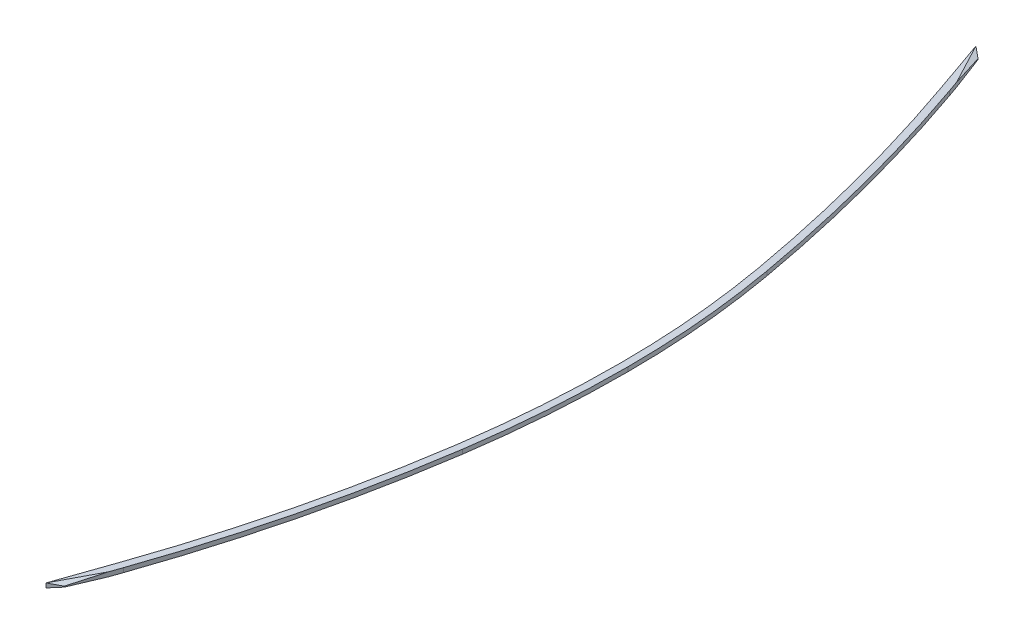
ISO-10303-21;
HEADER;
FILE_DESCRIPTION(('STEP AP214'),'2;1');
FILE_NAME('part.step','',(''),(''),'','','');
FILE_SCHEMA(('AUTOMOTIVE_DESIGN { 1 0 10303 214 1 1 1 1 }'));
ENDSEC;
DATA;
#1=APPLICATION_CONTEXT('core data for automotive mechanical design processes');
#2=APPLICATION_PROTOCOL_DEFINITION('international standard','automotive_design',2000,#1);
#3=PRODUCT_CONTEXT('',#1,'mechanical');
#4=PRODUCT('Part','Part','',(#3));
#5=PRODUCT_RELATED_PRODUCT_CATEGORY('part','',(#4));
#6=PRODUCT_DEFINITION_FORMATION('','',#4);
#7=PRODUCT_DEFINITION_CONTEXT('part definition',#1,'design');
#8=PRODUCT_DEFINITION('design','',#6,#7);
#9=PRODUCT_DEFINITION_SHAPE('','',#8);
#10=(LENGTH_UNIT() NAMED_UNIT(*) SI_UNIT(.MILLI.,.METRE.));
#11=(NAMED_UNIT(*) PLANE_ANGLE_UNIT() SI_UNIT($,.RADIAN.));
#12=(NAMED_UNIT(*) SI_UNIT($,.STERADIAN.) SOLID_ANGLE_UNIT());
#13=UNCERTAINTY_MEASURE_WITH_UNIT(LENGTH_MEASURE(1.E-05),#10,'distance_accuracy_value','');
#14=(GEOMETRIC_REPRESENTATION_CONTEXT(3) GLOBAL_UNCERTAINTY_ASSIGNED_CONTEXT((#13)) GLOBAL_UNIT_ASSIGNED_CONTEXT((#10,
#11,#12)) REPRESENTATION_CONTEXT('',''));
#15=CARTESIAN_POINT('',(0.,0.,0.));
#16=DIRECTION('',(0.,0.,1.));
#17=DIRECTION('',(1.,0.,0.));
#18=AXIS2_PLACEMENT_3D('',#15,#16,#17);
#19=CARTESIAN_POINT('',(-890.408602504765,-2.5,0.));
#20=DIRECTION('',(0.,-1.,0.));
#21=DIRECTION('',(0.,0.,-1.));
#22=AXIS2_PLACEMENT_3D('',#19,#20,#21);
#23=PLANE('',#22);
#24=DIRECTION('',(0.329290672717834,0.,0.944228602013854));
#25=VECTOR('',#24,1.);
#26=CARTESIAN_POINT('',(222.446171183886,-2.5,-457.365674618266));
#27=LINE('',#26,#25);
#28=CARTESIAN_POINT('',(200.603050676646,-2.5,-520.));
#29=VERTEX_POINT('',#28);
#30=CARTESIAN_POINT('',(222.446171183886,-2.5,-457.365674618266));
#31=VERTEX_POINT('',#30);
#32=EDGE_CURVE('E162',#29,#31,#27,.T.);
#33=ORIENTED_EDGE('',*,*,#32,.F.);
#34=DIRECTION('',(0.467302247857305,0.,0.884097624217773));
#35=VECTOR('',#34,1.);
#36=CARTESIAN_POINT('',(177.190538238726,-2.5,-564.294558218463));
#37=LINE('',#36,#35);
#38=CARTESIAN_POINT('',(225.506736635597,-2.5,-472.884263468604));
#39=VERTEX_POINT('',#38);
#40=EDGE_CURVE('E11',#29,#39,#37,.T.);
#41=ORIENTED_EDGE('',*,*,#40,.T.);
#42=DIRECTION('',(-0.329290672717833,0.,-0.944228602013854));
#43=VECTOR('',#42,1.);
#44=CARTESIAN_POINT('',(230.,-2.5,-460.));
#45=LINE('',#44,#43);
#46=CARTESIAN_POINT('',(230.,-2.5,-460.));
#47=VERTEX_POINT('',#46);
#48=EDGE_CURVE('E170',#47,#39,#45,.T.);
#49=ORIENTED_EDGE('',*,*,#48,.F.);
#50=CARTESIAN_POINT('',(-1518.12507111379,-2.5,149.641859433438));
#51=DIRECTION('',(0.,1.,0.));
#52=DIRECTION('',(0.,0.,-1.));
#53=AXIS2_PLACEMENT_3D('',#50,#51,#52);
#54=CIRCLE('',#53,1851.37907005293);
#55=CARTESIAN_POINT('',(304.432317629894,-2.5,-175.764080533639));
#56=VERTEX_POINT('',#55);
#57=EDGE_CURVE('E174',#56,#47,#54,.T.);
#58=ORIENTED_EDGE('',*,*,#57,.F.);
#59=CARTESIAN_POINT('',(-680.,-2.5,0.));
#60=DIRECTION('',(0.,1.,0.));
#61=DIRECTION('',(0.,0.,1.));
#62=AXIS2_PLACEMENT_3D('',#59,#60,#61);
#63=CIRCLE('',#62,1000.);
#64=CARTESIAN_POINT('',(320.,-2.5,0.));
#65=VERTEX_POINT('',#64);
#66=EDGE_CURVE('E279',#65,#56,#63,.T.);
#67=ORIENTED_EDGE('',*,*,#66,.F.);
#68=CARTESIAN_POINT('',(-890.408602504765,-2.5,0.));
#69=DIRECTION('',(0.,1.,0.));
#70=DIRECTION('',(0.,0.,-1.));
#71=AXIS2_PLACEMENT_3D('',#68,#69,#70);
#72=CIRCLE('',#71,1210.40860250476);
#73=CARTESIAN_POINT('',(306.955871138139,-2.5,177.221054830938));
#74=VERTEX_POINT('',#73);
#75=EDGE_CURVE('E281',#74,#65,#72,.T.);
#76=ORIENTED_EDGE('',*,*,#75,.F.);
#77=CARTESIAN_POINT('',(-1384.94196210794,-2.5,-73.1955269821214));
#78=DIRECTION('',(0.,1.,0.));
#79=DIRECTION('',(0.,0.,1.));
#80=AXIS2_PLACEMENT_3D('',#77,#78,#79);
#81=CIRCLE('',#80,1710.32942516631);
#82=CARTESIAN_POINT('',(230.,-2.5,490.));
#83=VERTEX_POINT('',#82);
#84=EDGE_CURVE('E188',#83,#74,#81,.T.);
#85=ORIENTED_EDGE('',*,*,#84,.F.);
#86=DIRECTION('',(0.329290672717831,0.,-0.944228602013855));
#87=VECTOR('',#86,1.);
#88=CARTESIAN_POINT('',(230.,-2.5,490.));
#89=LINE('',#88,#87);
#90=CARTESIAN_POINT('',(225.506736635596,-2.5,502.884263468605));
#91=VERTEX_POINT('',#90);
#92=EDGE_CURVE('E186',#91,#83,#89,.T.);
#93=ORIENTED_EDGE('',*,*,#92,.F.);
#94=DIRECTION('',(-0.467302247857303,0.,0.884097624217773));
#95=VECTOR('',#94,1.);
#96=CARTESIAN_POINT('',(189.584762452396,-2.5,570.845699944036));
#97=LINE('',#96,#95);
#98=CARTESIAN_POINT('',(200.603050676638,-2.5,550.));
#99=VERTEX_POINT('',#98);
#100=EDGE_CURVE('E261',#91,#99,#97,.T.);
#101=ORIENTED_EDGE('',*,*,#100,.T.);
#102=DIRECTION('',(-0.329290672717832,0.,0.944228602013854));
#103=VECTOR('',#102,1.);
#104=CARTESIAN_POINT('',(222.446171183889,-2.5,487.365674618257));
#105=LINE('',#104,#103);
#106=CARTESIAN_POINT('',(222.446171183889,-2.5,487.365674618257));
#107=VERTEX_POINT('',#106);
#108=EDGE_CURVE('E183',#107,#99,#105,.T.);
#109=ORIENTED_EDGE('',*,*,#108,.F.);
#110=CARTESIAN_POINT('',(-1384.94196210794,-2.5,-73.1955269821214));
#111=DIRECTION('',(0.,-1.,0.));
#112=DIRECTION('',(0.,0.,1.));
#113=AXIS2_PLACEMENT_3D('',#110,#111,#112);
#114=CIRCLE('',#113,1702.32942516631);
#115=CARTESIAN_POINT('',(299.042084199314,-2.5,176.049740916188));
#116=VERTEX_POINT('',#115);
#117=EDGE_CURVE('E181',#116,#107,#114,.T.);
#118=ORIENTED_EDGE('',*,*,#117,.F.);
#119=CARTESIAN_POINT('',(-890.408602504765,-2.5,0.));
#120=DIRECTION('',(0.,-1.,0.));
#121=DIRECTION('',(0.,0.,-1.));
#122=AXIS2_PLACEMENT_3D('',#119,#120,#121);
#123=CIRCLE('',#122,1202.40860250476);
#124=CARTESIAN_POINT('',(312.,-2.5,0.));
#125=VERTEX_POINT('',#124);
#126=EDGE_CURVE('E179',#125,#116,#123,.T.);
#127=ORIENTED_EDGE('',*,*,#126,.F.);
#128=CARTESIAN_POINT('',(-680.,-2.5,0.));
#129=DIRECTION('',(0.,-1.,0.));
#130=DIRECTION('',(0.,0.,1.));
#131=AXIS2_PLACEMENT_3D('',#128,#129,#130);
#132=CIRCLE('',#131,992.);
#133=CARTESIAN_POINT('',(296.556859088855,-2.5,-174.35796788937));
#134=VERTEX_POINT('',#133);
#135=EDGE_CURVE('E172',#134,#125,#132,.T.);
#136=ORIENTED_EDGE('',*,*,#135,.F.);
#137=CARTESIAN_POINT('',(-1518.12507111379,-2.5,149.641859433438));
#138=DIRECTION('',(0.,-1.,0.));
#139=DIRECTION('',(0.,0.,-1.));
#140=AXIS2_PLACEMENT_3D('',#137,#138,#139);
#141=CIRCLE('',#140,1843.37907005293);
#142=EDGE_CURVE('E169',#31,#134,#141,.T.);
#143=ORIENTED_EDGE('',*,*,#142,.F.);
#144=EDGE_LOOP('',(#33,#41,#49,#58,#67,#76,#85,#93,#101,#109,#118,#127,#136,#143));
#145=FACE_BOUND('',#144,.T.);
#146=ADVANCED_FACE('F31',(#145),#23,.T.);
#147=CARTESIAN_POINT('',(-890.408602504765,2.5,0.));
#148=DIRECTION('',(0.,-1.,0.));
#149=DIRECTION('',(0.,0.,-1.));
#150=AXIS2_PLACEMENT_3D('',#147,#148,#149);
#151=PLANE('',#150);
#152=DIRECTION('',(-0.329290672717833,0.,-0.944228602013854));
#153=VECTOR('',#152,1.);
#154=CARTESIAN_POINT('',(230.,2.5,-460.));
#155=LINE('',#154,#153);
#156=CARTESIAN_POINT('',(230.,2.5,-460.));
#157=VERTEX_POINT('',#156);
#158=CARTESIAN_POINT('',(225.506736635596,2.5,-472.884263468607));
#159=VERTEX_POINT('',#158);
#160=EDGE_CURVE('E197',#157,#159,#155,.T.);
#161=ORIENTED_EDGE('',*,*,#160,.T.);
#162=DIRECTION('',(-0.467302247857305,0.,-0.884097624217773));
#163=VECTOR('',#162,1.);
#164=CARTESIAN_POINT('',(177.190538238727,2.5,-564.294558218463));
#165=LINE('',#164,#163);
#166=CARTESIAN_POINT('',(200.603050676638,2.5,-520.));
#167=VERTEX_POINT('',#166);
#168=EDGE_CURVE('E157',#159,#167,#165,.T.);
#169=ORIENTED_EDGE('',*,*,#168,.T.);
#170=DIRECTION('',(0.329290672717834,0.,0.944228602013854));
#171=VECTOR('',#170,1.);
#172=CARTESIAN_POINT('',(222.446171183886,2.5,-457.365674618266));
#173=LINE('',#172,#171);
#174=CARTESIAN_POINT('',(222.446171183886,2.5,-457.365674618266));
#175=VERTEX_POINT('',#174);
#176=EDGE_CURVE('E164',#167,#175,#173,.T.);
#177=ORIENTED_EDGE('',*,*,#176,.T.);
#178=CARTESIAN_POINT('',(-1518.12507111379,2.5,149.641859433438));
#179=DIRECTION('',(0.,-1.,0.));
#180=DIRECTION('',(0.,0.,-1.));
#181=AXIS2_PLACEMENT_3D('',#178,#179,#180);
#182=CIRCLE('',#181,1843.37907005293);
#183=CARTESIAN_POINT('',(296.556859088855,2.5,-174.35796788937));
#184=VERTEX_POINT('',#183);
#185=EDGE_CURVE('E201',#175,#184,#182,.T.);
#186=ORIENTED_EDGE('',*,*,#185,.T.);
#187=CARTESIAN_POINT('',(-680.,2.5,0.));
#188=DIRECTION('',(0.,-1.,0.));
#189=DIRECTION('',(0.,0.,1.));
#190=AXIS2_PLACEMENT_3D('',#187,#188,#189);
#191=CIRCLE('',#190,992.);
#192=CARTESIAN_POINT('',(312.,2.5,0.));
#193=VERTEX_POINT('',#192);
#194=EDGE_CURVE('E203',#184,#193,#191,.T.);
#195=ORIENTED_EDGE('',*,*,#194,.T.);
#196=CARTESIAN_POINT('',(-890.408602504765,2.5,0.));
#197=DIRECTION('',(0.,-1.,0.));
#198=DIRECTION('',(0.,0.,-1.));
#199=AXIS2_PLACEMENT_3D('',#196,#197,#198);
#200=CIRCLE('',#199,1202.40860250476);
#201=CARTESIAN_POINT('',(299.042084199314,2.5,176.049740916188));
#202=VERTEX_POINT('',#201);
#203=EDGE_CURVE('E205',#193,#202,#200,.T.);
#204=ORIENTED_EDGE('',*,*,#203,.T.);
#205=CARTESIAN_POINT('',(-1384.94196210794,2.5,-73.1955269821214));
#206=DIRECTION('',(0.,-1.,0.));
#207=DIRECTION('',(0.,0.,1.));
#208=AXIS2_PLACEMENT_3D('',#205,#206,#207);
#209=CIRCLE('',#208,1702.32942516631);
#210=CARTESIAN_POINT('',(222.446171183889,2.5,487.365674618257));
#211=VERTEX_POINT('',#210);
#212=EDGE_CURVE('E207',#202,#211,#209,.T.);
#213=ORIENTED_EDGE('',*,*,#212,.T.);
#214=DIRECTION('',(-0.329290672717832,0.,0.944228602013854));
#215=VECTOR('',#214,1.);
#216=CARTESIAN_POINT('',(222.446171183889,2.5,487.365674618257));
#217=LINE('',#216,#215);
#218=CARTESIAN_POINT('',(200.603050676646,2.5,550.));
#219=VERTEX_POINT('',#218);
#220=EDGE_CURVE('E209',#211,#219,#217,.T.);
#221=ORIENTED_EDGE('',*,*,#220,.T.);
#222=DIRECTION('',(-0.467302247857303,0.,0.884097624217773));
#223=VECTOR('',#222,1.);
#224=CARTESIAN_POINT('',(189.584762452396,2.5,570.845699944036));
#225=LINE('',#224,#223);
#226=CARTESIAN_POINT('',(225.506736635596,2.5,502.884263468605));
#227=VERTEX_POINT('',#226);
#228=EDGE_CURVE('E52',#227,#219,#225,.T.);
#229=ORIENTED_EDGE('',*,*,#228,.F.);
#230=DIRECTION('',(0.329290672717831,0.,-0.944228602013855));
#231=VECTOR('',#230,1.);
#232=CARTESIAN_POINT('',(230.,2.5,490.));
#233=LINE('',#232,#231);
#234=CARTESIAN_POINT('',(230.,2.5,490.));
#235=VERTEX_POINT('',#234);
#236=EDGE_CURVE('E211',#227,#235,#233,.T.);
#237=ORIENTED_EDGE('',*,*,#236,.T.);
#238=CARTESIAN_POINT('',(-1384.94196210794,2.5,-73.1955269821214));
#239=DIRECTION('',(0.,1.,0.));
#240=DIRECTION('',(0.,0.,1.));
#241=AXIS2_PLACEMENT_3D('',#238,#239,#240);
#242=CIRCLE('',#241,1710.32942516631);
#243=CARTESIAN_POINT('',(306.955871138139,2.5,177.221054830938));
#244=VERTEX_POINT('',#243);
#245=EDGE_CURVE('E213',#235,#244,#242,.T.);
#246=ORIENTED_EDGE('',*,*,#245,.T.);
#247=CARTESIAN_POINT('',(-890.408602504765,2.5,0.));
#248=DIRECTION('',(0.,1.,0.));
#249=DIRECTION('',(0.,0.,-1.));
#250=AXIS2_PLACEMENT_3D('',#247,#248,#249);
#251=CIRCLE('',#250,1210.40860250476);
#252=CARTESIAN_POINT('',(320.,2.5,0.));
#253=VERTEX_POINT('',#252);
#254=EDGE_CURVE('E190',#244,#253,#251,.T.);
#255=ORIENTED_EDGE('',*,*,#254,.T.);
#256=CARTESIAN_POINT('',(-680.,2.5,0.));
#257=DIRECTION('',(0.,1.,0.));
#258=DIRECTION('',(0.,0.,1.));
#259=AXIS2_PLACEMENT_3D('',#256,#257,#258);
#260=CIRCLE('',#259,1000.);
#261=CARTESIAN_POINT('',(304.432317629894,2.5,-175.764080533639));
#262=VERTEX_POINT('',#261);
#263=EDGE_CURVE('E193',#253,#262,#260,.T.);
#264=ORIENTED_EDGE('',*,*,#263,.T.);
#265=CARTESIAN_POINT('',(-1518.12507111379,2.5,149.641859433438));
#266=DIRECTION('',(0.,1.,0.));
#267=DIRECTION('',(0.,0.,-1.));
#268=AXIS2_PLACEMENT_3D('',#265,#266,#267);
#269=CIRCLE('',#268,1851.37907005293);
#270=EDGE_CURVE('E195',#262,#157,#269,.T.);
#271=ORIENTED_EDGE('',*,*,#270,.T.);
#272=EDGE_LOOP('',(#161,#169,#177,#186,#195,#204,#213,#221,#229,#237,#246,#255,#264,#271));
#273=FACE_BOUND('',#272,.T.);
#274=ADVANCED_FACE('F270',(#273),#151,.F.);
#275=CARTESIAN_POINT('',(212.335109726883,2.5,-510.65340754916));
#276=DIRECTION('',(-0.623106163388615,0.,0.782137270015385));
#277=DIRECTION('',(0.782137270015386,0.,0.623106163388615));
#278=AXIS2_PLACEMENT_3D('',#275,#276,#277);
#279=PLANE('',#278);
#280=DIRECTION('',(0.775276284202998,0.132163720091018,0.617640214238108));
#281=VECTOR('',#280,1.);
#282=CARTESIAN_POINT('',(212.642499920339,-0.447598253275113,-510.408518663985));
#283=LINE('',#282,#281);
#284=CARTESIAN_POINT('',(212.335109726883,-0.500000000000002,-510.65340754916));
#285=VERTEX_POINT('',#284);
#286=EDGE_CURVE('E142',#29,#285,#283,.T.);
#287=ORIENTED_EDGE('',*,*,#286,.F.);
#288=DIRECTION('',(0.,-1.,0.));
#289=VECTOR('',#288,1.);
#290=CARTESIAN_POINT('',(200.603050676638,2.5,-520.));
#291=LINE('',#290,#289);
#292=EDGE_CURVE('E153',#167,#29,#291,.T.);
#293=ORIENTED_EDGE('',*,*,#292,.F.);
#294=DIRECTION('',(0.775276284202998,-0.132163720091018,0.617640214238108));
#295=VECTOR('',#294,1.);
#296=CARTESIAN_POINT('',(212.130182931246,0.534934497816596,-510.816666805943));
#297=LINE('',#296,#295);
#298=CARTESIAN_POINT('',(212.335109726883,0.500000000000002,-510.65340754916));
#299=VERTEX_POINT('',#298);
#300=EDGE_CURVE('E267',#167,#299,#297,.T.);
#301=ORIENTED_EDGE('',*,*,#300,.T.);
#302=DIRECTION('',(0.,-1.,0.));
#303=VECTOR('',#302,1.);
#304=CARTESIAN_POINT('',(212.335109726883,2.5,-510.65340754916));
#305=LINE('',#304,#303);
#306=EDGE_CURVE('E156',#299,#285,#305,.T.);
#307=ORIENTED_EDGE('',*,*,#306,.T.);
#308=EDGE_LOOP('',(#287,#293,#301,#307));
#309=FACE_BOUND('',#308,.T.);
#310=ADVANCED_FACE('F151',(#309),#279,.F.);
#311=CARTESIAN_POINT('',(230.,2.5,-460.));
#312=DIRECTION('',(-0.944228602013854,0.,0.329290672717833));
#313=DIRECTION('',(0.329290672717833,0.,0.944228602013854));
#314=AXIS2_PLACEMENT_3D('',#311,#312,#313);
#315=PLANE('',#314);
#316=DIRECTION('',(0.328879829547595,-0.0499376169438922,0.943050524696694));
#317=VECTOR('',#316,1.);
#318=CARTESIAN_POINT('',(229.90667747971,-3.16809375555623,-460.267598812145));
#319=LINE('',#318,#317);
#320=EDGE_CURVE('E39',#285,#39,#319,.T.);
#321=ORIENTED_EDGE('',*,*,#320,.F.);
#322=ORIENTED_EDGE('',*,*,#306,.F.);
#323=DIRECTION('',(0.328879829547595,0.0499376169438922,0.943050524696694));
#324=VECTOR('',#323,1.);
#325=CARTESIAN_POINT('',(229.988794854453,3.1805625834864,-460.032130332839));
#326=LINE('',#325,#324);
#327=EDGE_CURVE('E264',#299,#159,#326,.T.);
#328=ORIENTED_EDGE('',*,*,#327,.T.);
#329=ORIENTED_EDGE('',*,*,#160,.F.);
#330=DIRECTION('',(0.,-1.,0.));
#331=VECTOR('',#330,1.);
#332=CARTESIAN_POINT('',(230.,2.5,-460.));
#333=LINE('',#332,#331);
#334=EDGE_CURVE('E241',#157,#47,#333,.T.);
#335=ORIENTED_EDGE('',*,*,#334,.T.);
#336=ORIENTED_EDGE('',*,*,#48,.T.);
#337=EDGE_LOOP('',(#321,#322,#328,#329,#335,#336));
#338=FACE_BOUND('',#337,.T.);
#339=ADVANCED_FACE('F275',(#338),#315,.F.);
#340=CARTESIAN_POINT('',(-890.408602504765,2.5,0.));
#341=DIRECTION('',(0.,-1.,0.));
#342=DIRECTION('',(0.,0.,-1.));
#343=AXIS2_PLACEMENT_3D('',#340,#341,#342);
#344=CYLINDRICAL_SURFACE('',#343,1210.40860250476);
#345=ORIENTED_EDGE('',*,*,#75,.T.);
#346=DIRECTION('',(0.,-1.,0.));
#347=VECTOR('',#346,1.);
#348=CARTESIAN_POINT('',(320.,2.5,0.));
#349=LINE('',#348,#347);
#350=EDGE_CURVE('E247',#253,#65,#349,.T.);
#351=ORIENTED_EDGE('',*,*,#350,.F.);
#352=ORIENTED_EDGE('',*,*,#254,.F.);
#353=DIRECTION('',(0.,-1.,0.));
#354=VECTOR('',#353,1.);
#355=CARTESIAN_POINT('',(306.955871138139,2.5,177.221054830938));
#356=LINE('',#355,#354);
#357=EDGE_CURVE('E215',#244,#74,#356,.T.);
#358=ORIENTED_EDGE('',*,*,#357,.T.);
#359=EDGE_LOOP('',(#345,#351,#352,#358));
#360=FACE_BOUND('',#359,.T.);
#361=ADVANCED_FACE('F33',(#360),#344,.T.);
#362=CARTESIAN_POINT('',(-680.,2.5,0.));
#363=DIRECTION('',(0.,-1.,0.));
#364=DIRECTION('',(0.,0.,-1.));
#365=AXIS2_PLACEMENT_3D('',#362,#363,#364);
#366=CYLINDRICAL_SURFACE('',#365,1000.);
#367=ORIENTED_EDGE('',*,*,#66,.T.);
#368=DIRECTION('',(0.,-1.,0.));
#369=VECTOR('',#368,1.);
#370=CARTESIAN_POINT('',(304.432317629894,2.5,-175.764080533639));
#371=LINE('',#370,#369);
#372=EDGE_CURVE('E244',#262,#56,#371,.T.);
#373=ORIENTED_EDGE('',*,*,#372,.F.);
#374=ORIENTED_EDGE('',*,*,#263,.F.);
#375=ORIENTED_EDGE('',*,*,#350,.T.);
#376=EDGE_LOOP('',(#367,#373,#374,#375));
#377=FACE_BOUND('',#376,.T.);
#378=ADVANCED_FACE('F447',(#377),#366,.T.);
#379=CARTESIAN_POINT('',(-1518.12507111379,2.5,149.641859433438));
#380=DIRECTION('',(0.,-1.,0.));
#381=DIRECTION('',(0.,0.,-1.));
#382=AXIS2_PLACEMENT_3D('',#379,#380,#381);
#383=CYLINDRICAL_SURFACE('',#382,1851.37907005293);
#384=ORIENTED_EDGE('',*,*,#57,.T.);
#385=ORIENTED_EDGE('',*,*,#334,.F.);
#386=ORIENTED_EDGE('',*,*,#270,.F.);
#387=ORIENTED_EDGE('',*,*,#372,.T.);
#388=EDGE_LOOP('',(#384,#385,#386,#387));
#389=FACE_BOUND('',#388,.T.);
#390=ADVANCED_FACE('F334',(#389),#383,.T.);
#391=CARTESIAN_POINT('',(222.446171183886,2.5,-457.365674618266));
#392=DIRECTION('',(0.944228602013854,0.,-0.329290672717834));
#393=DIRECTION('',(-0.329290672717834,0.,-0.944228602013854));
#394=AXIS2_PLACEMENT_3D('',#391,#392,#393);
#395=PLANE('',#394);
#396=ORIENTED_EDGE('',*,*,#32,.T.);
#397=DIRECTION('',(0.,-1.,0.));
#398=VECTOR('',#397,1.);
#399=CARTESIAN_POINT('',(222.446171183886,2.5,-457.365674618266));
#400=LINE('',#399,#398);
#401=EDGE_CURVE('E165',#175,#31,#400,.T.);
#402=ORIENTED_EDGE('',*,*,#401,.F.);
#403=ORIENTED_EDGE('',*,*,#176,.F.);
#404=ORIENTED_EDGE('',*,*,#292,.T.);
#405=EDGE_LOOP('',(#396,#402,#403,#404));
#406=FACE_BOUND('',#405,.T.);
#407=ADVANCED_FACE('F160',(#406),#395,.F.);
#408=CARTESIAN_POINT('',(-1518.12507111379,2.5,149.641859433438));
#409=DIRECTION('',(0.,-1.,0.));
#410=DIRECTION('',(0.,0.,-1.));
#411=AXIS2_PLACEMENT_3D('',#408,#409,#410);
#412=CYLINDRICAL_SURFACE('',#411,1843.37907005293);
#413=ORIENTED_EDGE('',*,*,#142,.T.);
#414=DIRECTION('',(0.,-1.,0.));
#415=VECTOR('',#414,1.);
#416=CARTESIAN_POINT('',(296.556859088855,2.5,-174.35796788937));
#417=LINE('',#416,#415);
#418=EDGE_CURVE('E236',#184,#134,#417,.T.);
#419=ORIENTED_EDGE('',*,*,#418,.F.);
#420=ORIENTED_EDGE('',*,*,#185,.F.);
#421=ORIENTED_EDGE('',*,*,#401,.T.);
#422=EDGE_LOOP('',(#413,#419,#420,#421));
#423=FACE_BOUND('',#422,.T.);
#424=ADVANCED_FACE('F326',(#423),#412,.F.);
#425=CARTESIAN_POINT('',(-680.,2.5,0.));
#426=DIRECTION('',(0.,-1.,0.));
#427=DIRECTION('',(0.,0.,-1.));
#428=AXIS2_PLACEMENT_3D('',#425,#426,#427);
#429=CYLINDRICAL_SURFACE('',#428,992.);
#430=ORIENTED_EDGE('',*,*,#135,.T.);
#431=DIRECTION('',(0.,-1.,0.));
#432=VECTOR('',#431,1.);
#433=CARTESIAN_POINT('',(312.,2.5,0.));
#434=LINE('',#433,#432);
#435=EDGE_CURVE('E233',#193,#125,#434,.T.);
#436=ORIENTED_EDGE('',*,*,#435,.F.);
#437=ORIENTED_EDGE('',*,*,#194,.F.);
#438=ORIENTED_EDGE('',*,*,#418,.T.);
#439=EDGE_LOOP('',(#430,#436,#437,#438));
#440=FACE_BOUND('',#439,.T.);
#441=ADVANCED_FACE('F322',(#440),#429,.F.);
#442=CARTESIAN_POINT('',(-890.408602504765,2.5,0.));
#443=DIRECTION('',(0.,-1.,0.));
#444=DIRECTION('',(0.,0.,-1.));
#445=AXIS2_PLACEMENT_3D('',#442,#443,#444);
#446=CYLINDRICAL_SURFACE('',#445,1202.40860250476);
#447=ORIENTED_EDGE('',*,*,#126,.T.);
#448=DIRECTION('',(0.,-1.,0.));
#449=VECTOR('',#448,1.);
#450=CARTESIAN_POINT('',(299.042084199314,2.5,176.049740916188));
#451=LINE('',#450,#449);
#452=EDGE_CURVE('E230',#202,#116,#451,.T.);
#453=ORIENTED_EDGE('',*,*,#452,.F.);
#454=ORIENTED_EDGE('',*,*,#203,.F.);
#455=ORIENTED_EDGE('',*,*,#435,.T.);
#456=EDGE_LOOP('',(#447,#453,#454,#455));
#457=FACE_BOUND('',#456,.T.);
#458=ADVANCED_FACE('F318',(#457),#446,.F.);
#459=CARTESIAN_POINT('',(-1384.94196210794,2.5,-73.1955269821214));
#460=DIRECTION('',(0.,-1.,0.));
#461=DIRECTION('',(0.,0.,-1.));
#462=AXIS2_PLACEMENT_3D('',#459,#460,#461);
#463=CYLINDRICAL_SURFACE('',#462,1702.32942516631);
#464=ORIENTED_EDGE('',*,*,#117,.T.);
#465=DIRECTION('',(0.,-1.,0.));
#466=VECTOR('',#465,1.);
#467=CARTESIAN_POINT('',(222.446171183889,2.5,487.365674618257));
#468=LINE('',#467,#466);
#469=EDGE_CURVE('E227',#211,#107,#468,.T.);
#470=ORIENTED_EDGE('',*,*,#469,.F.);
#471=ORIENTED_EDGE('',*,*,#212,.F.);
#472=ORIENTED_EDGE('',*,*,#452,.T.);
#473=EDGE_LOOP('',(#464,#470,#471,#472));
#474=FACE_BOUND('',#473,.T.);
#475=ADVANCED_FACE('F314',(#474),#463,.F.);
#476=CARTESIAN_POINT('',(222.446171183889,2.5,487.365674618257));
#477=DIRECTION('',(0.944228602013854,0.,0.329290672717832));
#478=DIRECTION('',(0.329290672717832,0.,-0.944228602013854));
#479=AXIS2_PLACEMENT_3D('',#476,#477,#478);
#480=PLANE('',#479);
#481=ORIENTED_EDGE('',*,*,#108,.T.);
#482=DIRECTION('',(0.,-1.,0.));
#483=VECTOR('',#482,1.);
#484=CARTESIAN_POINT('',(200.603050676638,2.5,550.));
#485=LINE('',#484,#483);
#486=EDGE_CURVE('E224',#219,#99,#485,.T.);
#487=ORIENTED_EDGE('',*,*,#486,.F.);
#488=ORIENTED_EDGE('',*,*,#220,.F.);
#489=ORIENTED_EDGE('',*,*,#469,.T.);
#490=EDGE_LOOP('',(#481,#487,#488,#489));
#491=FACE_BOUND('',#490,.T.);
#492=ADVANCED_FACE('F307',(#491),#480,.F.);
#493=CARTESIAN_POINT('',(212.335109726883,2.5,540.65340754916));
#494=DIRECTION('',(-0.623106163388619,0.,-0.782137270015383));
#495=DIRECTION('',(-0.782137270015383,0.,0.623106163388619));
#496=AXIS2_PLACEMENT_3D('',#493,#494,#495);
#497=PLANE('',#496);
#498=DIRECTION('',(-0.775276284202995,-0.132163720091017,0.617640214238112));
#499=VECTOR('',#498,1.);
#500=CARTESIAN_POINT('',(212.642499920339,-0.447598253275113,540.408518663985));
#501=LINE('',#500,#499);
#502=CARTESIAN_POINT('',(212.335109726883,-0.500000000000002,540.65340754916));
#503=VERTEX_POINT('',#502);
#504=EDGE_CURVE('E257',#503,#99,#501,.T.);
#505=ORIENTED_EDGE('',*,*,#504,.F.);
#506=DIRECTION('',(0.,-1.,0.));
#507=VECTOR('',#506,1.);
#508=CARTESIAN_POINT('',(212.335109726883,2.5,540.65340754916));
#509=LINE('',#508,#507);
#510=CARTESIAN_POINT('',(212.335109726883,0.500000000000004,540.65340754916));
#511=VERTEX_POINT('',#510);
#512=EDGE_CURVE('E221',#511,#503,#509,.T.);
#513=ORIENTED_EDGE('',*,*,#512,.F.);
#514=DIRECTION('',(0.775276284202995,-0.132163720091017,-0.617640214238112));
#515=VECTOR('',#514,1.);
#516=CARTESIAN_POINT('',(212.130182931246,0.534934497816596,540.816666805943));
#517=LINE('',#516,#515);
#518=EDGE_CURVE('E250',#219,#511,#517,.T.);
#519=ORIENTED_EDGE('',*,*,#518,.F.);
#520=ORIENTED_EDGE('',*,*,#486,.T.);
#521=EDGE_LOOP('',(#505,#513,#519,#520));
#522=FACE_BOUND('',#521,.T.);
#523=ADVANCED_FACE('F303',(#522),#497,.F.);
#524=CARTESIAN_POINT('',(230.,2.5,490.));
#525=DIRECTION('',(-0.944228602013855,0.,-0.329290672717831));
#526=DIRECTION('',(-0.329290672717831,0.,0.944228602013855));
#527=AXIS2_PLACEMENT_3D('',#524,#525,#526);
#528=PLANE('',#527);
#529=DIRECTION('',(-0.328879829547593,0.0499376169438921,0.943050524696695));
#530=VECTOR('',#529,1.);
#531=CARTESIAN_POINT('',(229.90667747971,-3.16809375555622,490.267598812145));
#532=LINE('',#531,#530);
#533=EDGE_CURVE('E259',#91,#503,#532,.T.);
#534=ORIENTED_EDGE('',*,*,#533,.F.);
#535=ORIENTED_EDGE('',*,*,#92,.T.);
#536=DIRECTION('',(0.,-1.,0.));
#537=VECTOR('',#536,1.);
#538=CARTESIAN_POINT('',(230.,2.5,490.));
#539=LINE('',#538,#537);
#540=EDGE_CURVE('E218',#235,#83,#539,.T.);
#541=ORIENTED_EDGE('',*,*,#540,.F.);
#542=ORIENTED_EDGE('',*,*,#236,.F.);
#543=DIRECTION('',(0.328879829547593,0.0499376169438921,-0.943050524696695));
#544=VECTOR('',#543,1.);
#545=CARTESIAN_POINT('',(229.988794854453,3.18056258348639,490.032130332839));
#546=LINE('',#545,#544);
#547=EDGE_CURVE('E253',#511,#227,#546,.T.);
#548=ORIENTED_EDGE('',*,*,#547,.F.);
#549=ORIENTED_EDGE('',*,*,#512,.T.);
#550=EDGE_LOOP('',(#534,#535,#541,#542,#548,#549));
#551=FACE_BOUND('',#550,.T.);
#552=ADVANCED_FACE('F297',(#551),#528,.F.);
#553=CARTESIAN_POINT('',(-1384.94196210794,2.5,-73.1955269821214));
#554=DIRECTION('',(0.,-1.,0.));
#555=DIRECTION('',(0.,0.,-1.));
#556=AXIS2_PLACEMENT_3D('',#553,#554,#555);
#557=CYLINDRICAL_SURFACE('',#556,1710.32942516631);
#558=ORIENTED_EDGE('',*,*,#84,.T.);
#559=ORIENTED_EDGE('',*,*,#357,.F.);
#560=ORIENTED_EDGE('',*,*,#245,.F.);
#561=ORIENTED_EDGE('',*,*,#540,.T.);
#562=EDGE_LOOP('',(#558,#559,#560,#561));
#563=FACE_BOUND('',#562,.T.);
#564=ADVANCED_FACE('F292',(#563),#557,.T.);
#565=CARTESIAN_POINT('',(200.480931526622,2.50666666666667,550.188207763263));
#566=DIRECTION('',(0.279383356314473,0.948755984754413,0.14767200685013));
#567=DIRECTION('',(-0.959273081847596,0.28248036116271,0.));
#568=AXIS2_PLACEMENT_3D('',#565,#566,#567);
#569=PLANE('',#568);
#570=ORIENTED_EDGE('',*,*,#228,.T.);
#571=ORIENTED_EDGE('',*,*,#518,.T.);
#572=ORIENTED_EDGE('',*,*,#547,.T.);
#573=EDGE_LOOP('',(#570,#571,#572));
#574=FACE_BOUND('',#573,.T.);
#575=ADVANCED_FACE('F343',(#574),#569,.T.);
#576=CARTESIAN_POINT('',(212.330311167355,-0.486666666666667,540.748149387925));
#577=DIRECTION('',(0.279383356314472,-0.948755984754413,0.14767200685013));
#578=DIRECTION('',(0.959273081847596,0.28248036116271,0.));
#579=AXIS2_PLACEMENT_3D('',#576,#577,#578);
#580=PLANE('',#579);
#581=ORIENTED_EDGE('',*,*,#533,.T.);
#582=ORIENTED_EDGE('',*,*,#504,.T.);
#583=ORIENTED_EDGE('',*,*,#100,.F.);
#584=EDGE_LOOP('',(#581,#582,#583));
#585=FACE_BOUND('',#584,.T.);
#586=ADVANCED_FACE('F301',(#585),#580,.T.);
#587=CARTESIAN_POINT('',(200.480931526622,2.50666666666667,-520.188207763263));
#588=DIRECTION('',(-0.279383356314472,-0.948755984754413,0.147672006850131));
#589=DIRECTION('',(0.959273081847596,-0.28248036116271,0.));
#590=AXIS2_PLACEMENT_3D('',#587,#588,#589);
#591=PLANE('',#590);
#592=ORIENTED_EDGE('',*,*,#327,.F.);
#593=ORIENTED_EDGE('',*,*,#300,.F.);
#594=ORIENTED_EDGE('',*,*,#168,.F.);
#595=EDGE_LOOP('',(#592,#593,#594));
#596=FACE_BOUND('',#595,.T.);
#597=ADVANCED_FACE('F273',(#596),#591,.F.);
#598=CARTESIAN_POINT('',(212.330311167355,-0.486666666666667,-510.748149387925));
#599=DIRECTION('',(0.279383356314472,-0.948755984754413,-0.147672006850131));
#600=DIRECTION('',(0.959273081847596,0.28248036116271,0.));
#601=AXIS2_PLACEMENT_3D('',#598,#599,#600);
#602=PLANE('',#601);
#603=ORIENTED_EDGE('',*,*,#40,.F.);
#604=ORIENTED_EDGE('',*,*,#286,.T.);
#605=ORIENTED_EDGE('',*,*,#320,.T.);
#606=EDGE_LOOP('',(#603,#604,#605));
#607=FACE_BOUND('',#606,.T.);
#608=ADVANCED_FACE('F141',(#607),#602,.T.);
#609=CLOSED_SHELL('',(#146,#274,#310,#339,#361,#378,#390,#407,#424,#441,#458,#475,#492,#523,
#552,#564,#575,#586,#597,#608));
#610=MANIFOLD_SOLID_BREP('B2',#609);
#611=ADVANCED_BREP_SHAPE_REPRESENTATION('',(#18,#610),#14);
#612=SHAPE_DEFINITION_REPRESENTATION(#9,#611);
ENDSEC;
END-ISO-10303-21;
